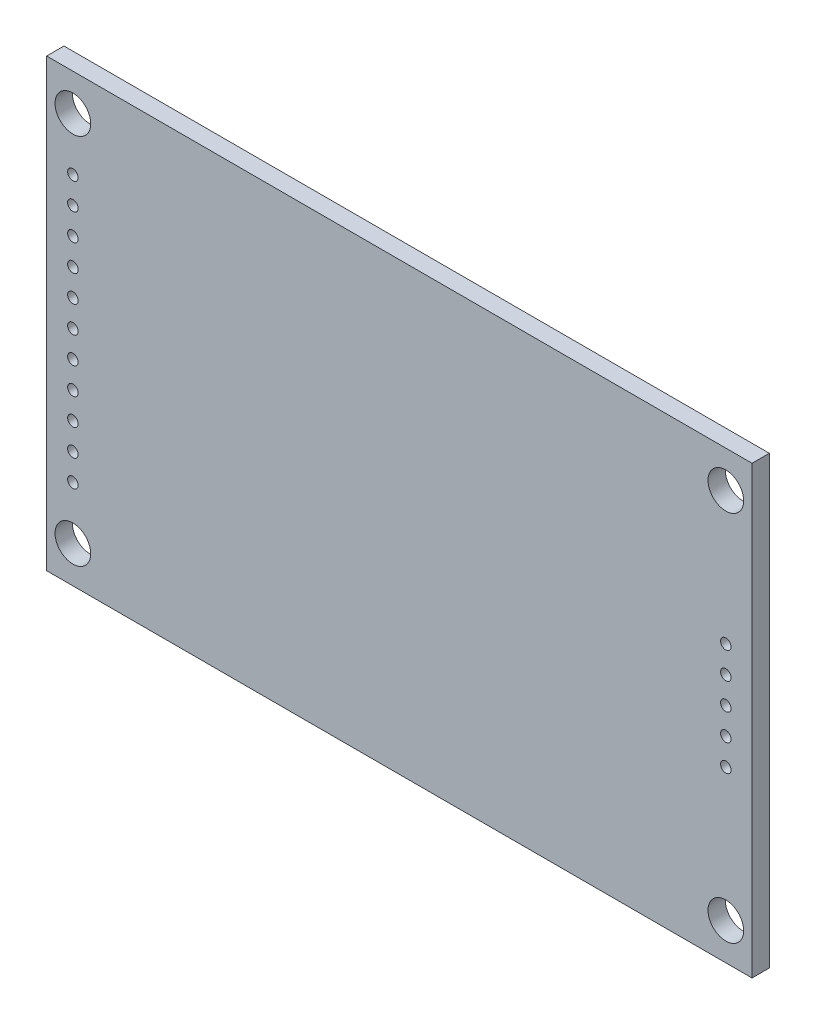
ISO-10303-21;
HEADER;
FILE_DESCRIPTION(('STEP AP214'),'2;1');
FILE_NAME('part.step','',(''),(''),'','','');
FILE_SCHEMA(('AUTOMOTIVE_DESIGN { 1 0 10303 214 1 1 1 1 }'));
ENDSEC;
DATA;
#1=APPLICATION_CONTEXT('core data for automotive mechanical design processes');
#2=APPLICATION_PROTOCOL_DEFINITION('international standard','automotive_design',2000,#1);
#3=PRODUCT_CONTEXT('',#1,'mechanical');
#4=PRODUCT('Part','Part','',(#3));
#5=PRODUCT_RELATED_PRODUCT_CATEGORY('part','',(#4));
#6=PRODUCT_DEFINITION_FORMATION('','',#4);
#7=PRODUCT_DEFINITION_CONTEXT('part definition',#1,'design');
#8=PRODUCT_DEFINITION('design','',#6,#7);
#9=PRODUCT_DEFINITION_SHAPE('','',#8);
#10=(LENGTH_UNIT() NAMED_UNIT(*) SI_UNIT(.MILLI.,.METRE.));
#11=(NAMED_UNIT(*) PLANE_ANGLE_UNIT() SI_UNIT($,.RADIAN.));
#12=(NAMED_UNIT(*) SI_UNIT($,.STERADIAN.) SOLID_ANGLE_UNIT());
#13=UNCERTAINTY_MEASURE_WITH_UNIT(LENGTH_MEASURE(1.E-05),#10,'distance_accuracy_value','');
#14=(GEOMETRIC_REPRESENTATION_CONTEXT(3) GLOBAL_UNCERTAINTY_ASSIGNED_CONTEXT((#13)) GLOBAL_UNIT_ASSIGNED_CONTEXT((#10,
#11,#12)) REPRESENTATION_CONTEXT('',''));
#15=CARTESIAN_POINT('',(0.,0.,0.));
#16=DIRECTION('',(0.,0.,1.));
#17=DIRECTION('',(1.,0.,0.));
#18=AXIS2_PLACEMENT_3D('',#15,#16,#17);
#19=CARTESIAN_POINT('',(33.625,-21.25,1.65));
#20=DIRECTION('',(-1.,0.,0.));
#21=DIRECTION('',(0.,-1.,0.));
#22=AXIS2_PLACEMENT_3D('',#19,#20,#21);
#23=PLANE('',#22);
#24=DIRECTION('',(0.,1.,0.));
#25=VECTOR('',#24,1.);
#26=CARTESIAN_POINT('',(33.625,-21.25,0.));
#27=LINE('',#26,#25);
#28=CARTESIAN_POINT('',(33.625,-21.25,0.));
#29=VERTEX_POINT('',#28);
#30=CARTESIAN_POINT('',(33.625,21.25,0.));
#31=VERTEX_POINT('',#30);
#32=EDGE_CURVE('E96',#29,#31,#27,.T.);
#33=ORIENTED_EDGE('',*,*,#32,.T.);
#34=DIRECTION('',(0.,0.,-1.));
#35=VECTOR('',#34,1.);
#36=CARTESIAN_POINT('',(33.625,21.25,1.65));
#37=LINE('',#36,#35);
#38=CARTESIAN_POINT('',(33.625,21.25,1.65));
#39=VERTEX_POINT('',#38);
#40=EDGE_CURVE('E11',#39,#31,#37,.T.);
#41=ORIENTED_EDGE('',*,*,#40,.F.);
#42=DIRECTION('',(0.,1.,0.));
#43=VECTOR('',#42,1.);
#44=CARTESIAN_POINT('',(33.625,-21.25,1.65));
#45=LINE('',#44,#43);
#46=CARTESIAN_POINT('',(33.625,-21.25,1.65));
#47=VERTEX_POINT('',#46);
#48=EDGE_CURVE('E84',#47,#39,#45,.T.);
#49=ORIENTED_EDGE('',*,*,#48,.F.);
#50=DIRECTION('',(0.,0.,-1.));
#51=VECTOR('',#50,1.);
#52=CARTESIAN_POINT('',(33.625,-21.25,1.65));
#53=LINE('',#52,#51);
#54=EDGE_CURVE('E92',#47,#29,#53,.T.);
#55=ORIENTED_EDGE('',*,*,#54,.T.);
#56=EDGE_LOOP('',(#33,#41,#49,#55));
#57=FACE_BOUND('',#56,.T.);
#58=ADVANCED_FACE('F33',(#57),#23,.F.);
#59=CARTESIAN_POINT('',(-33.625,21.25,1.65));
#60=DIRECTION('',(0.,-1.,0.));
#61=DIRECTION('',(1.,0.,0.));
#62=AXIS2_PLACEMENT_3D('',#59,#60,#61);
#63=PLANE('',#62);
#64=DIRECTION('',(-1.,0.,0.));
#65=VECTOR('',#64,1.);
#66=CARTESIAN_POINT('',(-33.625,21.25,0.));
#67=LINE('',#66,#65);
#68=CARTESIAN_POINT('',(-33.625,21.25,0.));
#69=VERTEX_POINT('',#68);
#70=EDGE_CURVE('E88',#31,#69,#67,.T.);
#71=ORIENTED_EDGE('',*,*,#70,.T.);
#72=DIRECTION('',(0.,0.,-1.));
#73=VECTOR('',#72,1.);
#74=CARTESIAN_POINT('',(-33.625,21.25,1.65));
#75=LINE('',#74,#73);
#76=CARTESIAN_POINT('',(-33.625,21.25,1.65));
#77=VERTEX_POINT('',#76);
#78=EDGE_CURVE('E41',#77,#69,#75,.T.);
#79=ORIENTED_EDGE('',*,*,#78,.F.);
#80=DIRECTION('',(-1.,0.,0.));
#81=VECTOR('',#80,1.);
#82=CARTESIAN_POINT('',(-33.625,21.25,1.65));
#83=LINE('',#82,#81);
#84=EDGE_CURVE('E79',#39,#77,#83,.T.);
#85=ORIENTED_EDGE('',*,*,#84,.F.);
#86=ORIENTED_EDGE('',*,*,#40,.T.);
#87=EDGE_LOOP('',(#71,#79,#85,#86));
#88=FACE_BOUND('',#87,.T.);
#89=ADVANCED_FACE('F87',(#88),#63,.F.);
#90=CARTESIAN_POINT('',(-33.625,-21.25,1.65));
#91=DIRECTION('',(1.,0.,0.));
#92=DIRECTION('',(0.,1.,0.));
#93=AXIS2_PLACEMENT_3D('',#90,#91,#92);
#94=PLANE('',#93);
#95=DIRECTION('',(0.,-1.,0.));
#96=VECTOR('',#95,1.);
#97=CARTESIAN_POINT('',(-33.625,-21.25,0.));
#98=LINE('',#97,#96);
#99=CARTESIAN_POINT('',(-33.625,-21.25,0.));
#100=VERTEX_POINT('',#99);
#101=EDGE_CURVE('E66',#69,#100,#98,.T.);
#102=ORIENTED_EDGE('',*,*,#101,.T.);
#103=DIRECTION('',(0.,0.,-1.));
#104=VECTOR('',#103,1.);
#105=CARTESIAN_POINT('',(-33.625,-21.25,1.65));
#106=LINE('',#105,#104);
#107=CARTESIAN_POINT('',(-33.625,-21.25,1.65));
#108=VERTEX_POINT('',#107);
#109=EDGE_CURVE('E89',#108,#100,#106,.T.);
#110=ORIENTED_EDGE('',*,*,#109,.F.);
#111=DIRECTION('',(0.,-1.,0.));
#112=VECTOR('',#111,1.);
#113=CARTESIAN_POINT('',(-33.625,-21.25,1.65));
#114=LINE('',#113,#112);
#115=EDGE_CURVE('E82',#77,#108,#114,.T.);
#116=ORIENTED_EDGE('',*,*,#115,.F.);
#117=ORIENTED_EDGE('',*,*,#78,.T.);
#118=EDGE_LOOP('',(#102,#110,#116,#117));
#119=FACE_BOUND('',#118,.T.);
#120=ADVANCED_FACE('F90',(#119),#94,.F.);
#121=CARTESIAN_POINT('',(-33.625,-21.25,1.65));
#122=DIRECTION('',(0.,1.,0.));
#123=DIRECTION('',(0.,0.,1.));
#124=AXIS2_PLACEMENT_3D('',#121,#122,#123);
#125=PLANE('',#124);
#126=DIRECTION('',(1.,0.,0.));
#127=VECTOR('',#126,1.);
#128=CARTESIAN_POINT('',(-33.625,-21.25,0.));
#129=LINE('',#128,#127);
#130=EDGE_CURVE('E72',#100,#29,#129,.T.);
#131=ORIENTED_EDGE('',*,*,#130,.T.);
#132=ORIENTED_EDGE('',*,*,#54,.F.);
#133=DIRECTION('',(1.,0.,0.));
#134=VECTOR('',#133,1.);
#135=CARTESIAN_POINT('',(-33.625,-21.25,1.65));
#136=LINE('',#135,#134);
#137=EDGE_CURVE('E49',#108,#47,#136,.T.);
#138=ORIENTED_EDGE('',*,*,#137,.F.);
#139=ORIENTED_EDGE('',*,*,#109,.T.);
#140=EDGE_LOOP('',(#131,#132,#138,#139));
#141=FACE_BOUND('',#140,.T.);
#142=ADVANCED_FACE('F104',(#141),#125,.F.);
#143=CARTESIAN_POINT('',(0.,0.,1.65));
#144=DIRECTION('',(0.,0.,-1.));
#145=DIRECTION('',(-1.,0.,0.));
#146=AXIS2_PLACEMENT_3D('',#143,#144,#145);
#147=PLANE('',#146);
#148=CARTESIAN_POINT('',(31.125,2.54000000000002,1.65));
#149=DIRECTION('',(0.,0.,1.));
#150=DIRECTION('',(1.,0.,0.));
#151=AXIS2_PLACEMENT_3D('',#148,#149,#150);
#152=CIRCLE('',#151,0.500000000000002);
#153=CARTESIAN_POINT('',(31.625,2.54000000000002,1.65));
#154=VERTEX_POINT('',#153);
#155=EDGE_CURVE('E224',#154,#154,#152,.T.);
#156=ORIENTED_EDGE('',*,*,#155,.F.);
#157=EDGE_LOOP('',(#156));
#158=FACE_BOUND('',#157,.T.);
#159=CARTESIAN_POINT('',(31.125,5.08000000000002,1.65));
#160=DIRECTION('',(0.,0.,1.));
#161=DIRECTION('',(1.,0.,0.));
#162=AXIS2_PLACEMENT_3D('',#159,#160,#161);
#163=CIRCLE('',#162,0.499999999999996);
#164=CARTESIAN_POINT('',(31.625,5.08000000000002,1.65));
#165=VERTEX_POINT('',#164);
#166=EDGE_CURVE('E218',#165,#165,#163,.T.);
#167=ORIENTED_EDGE('',*,*,#166,.F.);
#168=EDGE_LOOP('',(#167));
#169=FACE_BOUND('',#168,.T.);
#170=CARTESIAN_POINT('',(31.125,-2.53999999999998,1.65));
#171=DIRECTION('',(0.,0.,1.));
#172=DIRECTION('',(1.,0.,0.));
#173=AXIS2_PLACEMENT_3D('',#170,#171,#172);
#174=CIRCLE('',#173,0.499999999999999);
#175=CARTESIAN_POINT('',(31.625,-2.53999999999998,1.65));
#176=VERTEX_POINT('',#175);
#177=EDGE_CURVE('E212',#176,#176,#174,.T.);
#178=ORIENTED_EDGE('',*,*,#177,.F.);
#179=EDGE_LOOP('',(#178));
#180=FACE_BOUND('',#179,.T.);
#181=CARTESIAN_POINT('',(31.1250000000001,-5.07999999999998,1.65));
#182=DIRECTION('',(0.,0.,1.));
#183=DIRECTION('',(1.,0.,0.));
#184=AXIS2_PLACEMENT_3D('',#181,#182,#183);
#185=CIRCLE('',#184,0.500000000000003);
#186=CARTESIAN_POINT('',(31.6250000000001,-5.07999999999998,1.65));
#187=VERTEX_POINT('',#186);
#188=EDGE_CURVE('E206',#187,#187,#185,.T.);
#189=ORIENTED_EDGE('',*,*,#188,.F.);
#190=EDGE_LOOP('',(#189));
#191=FACE_BOUND('',#190,.T.);
#192=CARTESIAN_POINT('',(31.125,0.,1.65));
#193=DIRECTION('',(0.,0.,1.));
#194=DIRECTION('',(1.,0.,0.));
#195=AXIS2_PLACEMENT_3D('',#192,#193,#194);
#196=CIRCLE('',#195,0.499999999999999);
#197=CARTESIAN_POINT('',(31.625,0.,1.65));
#198=VERTEX_POINT('',#197);
#199=EDGE_CURVE('E200',#198,#198,#196,.T.);
#200=ORIENTED_EDGE('',*,*,#199,.F.);
#201=EDGE_LOOP('',(#200));
#202=FACE_BOUND('',#201,.T.);
#203=CARTESIAN_POINT('',(-31.125,-2.53999999999999,1.65));
#204=DIRECTION('',(0.,0.,1.));
#205=DIRECTION('',(1.,0.,0.));
#206=AXIS2_PLACEMENT_3D('',#203,#204,#205);
#207=CIRCLE('',#206,0.499999999999999);
#208=CARTESIAN_POINT('',(-30.625,-2.53999999999999,1.65));
#209=VERTEX_POINT('',#208);
#210=EDGE_CURVE('E195',#209,#209,#207,.T.);
#211=ORIENTED_EDGE('',*,*,#210,.F.);
#212=EDGE_LOOP('',(#211));
#213=FACE_BOUND('',#212,.T.);
#214=CARTESIAN_POINT('',(-31.1249999999999,-5.07999999999999,1.65));
#215=DIRECTION('',(0.,0.,1.));
#216=DIRECTION('',(1.,0.,0.));
#217=AXIS2_PLACEMENT_3D('',#214,#215,#216);
#218=CIRCLE('',#217,0.499999999999999);
#219=CARTESIAN_POINT('',(-30.6249999999999,-5.07999999999999,1.65));
#220=VERTEX_POINT('',#219);
#221=EDGE_CURVE('E189',#220,#220,#218,.T.);
#222=ORIENTED_EDGE('',*,*,#221,.F.);
#223=EDGE_LOOP('',(#222));
#224=FACE_BOUND('',#223,.T.);
#225=CARTESIAN_POINT('',(-31.1249999999999,-7.61999999999999,1.65));
#226=DIRECTION('',(0.,0.,1.));
#227=DIRECTION('',(1.,0.,0.));
#228=AXIS2_PLACEMENT_3D('',#225,#226,#227);
#229=CIRCLE('',#228,0.499999999999999);
#230=CARTESIAN_POINT('',(-30.6249999999999,-7.61999999999999,1.65));
#231=VERTEX_POINT('',#230);
#232=EDGE_CURVE('E183',#231,#231,#229,.T.);
#233=ORIENTED_EDGE('',*,*,#232,.F.);
#234=EDGE_LOOP('',(#233));
#235=FACE_BOUND('',#234,.T.);
#236=CARTESIAN_POINT('',(-31.1249999999999,-10.16,1.65));
#237=DIRECTION('',(0.,0.,1.));
#238=DIRECTION('',(1.,0.,0.));
#239=AXIS2_PLACEMENT_3D('',#236,#237,#238);
#240=CIRCLE('',#239,0.499999999999999);
#241=CARTESIAN_POINT('',(-30.6249999999999,-10.16,1.65));
#242=VERTEX_POINT('',#241);
#243=EDGE_CURVE('E177',#242,#242,#240,.T.);
#244=ORIENTED_EDGE('',*,*,#243,.F.);
#245=EDGE_LOOP('',(#244));
#246=FACE_BOUND('',#245,.T.);
#247=CARTESIAN_POINT('',(-31.1249999999999,-12.7,1.65));
#248=DIRECTION('',(0.,0.,1.));
#249=DIRECTION('',(1.,0.,0.));
#250=AXIS2_PLACEMENT_3D('',#247,#248,#249);
#251=CIRCLE('',#250,0.499999999999999);
#252=CARTESIAN_POINT('',(-30.6249999999999,-12.7,1.65));
#253=VERTEX_POINT('',#252);
#254=EDGE_CURVE('E171',#253,#253,#251,.T.);
#255=ORIENTED_EDGE('',*,*,#254,.F.);
#256=EDGE_LOOP('',(#255));
#257=FACE_BOUND('',#256,.T.);
#258=CARTESIAN_POINT('',(-31.125,2.54000000000001,1.65));
#259=DIRECTION('',(0.,0.,1.));
#260=DIRECTION('',(1.,0.,0.));
#261=AXIS2_PLACEMENT_3D('',#258,#259,#260);
#262=CIRCLE('',#261,0.499999999999999);
#263=CARTESIAN_POINT('',(-30.625,2.54000000000001,1.65));
#264=VERTEX_POINT('',#263);
#265=EDGE_CURVE('E165',#264,#264,#262,.T.);
#266=ORIENTED_EDGE('',*,*,#265,.F.);
#267=EDGE_LOOP('',(#266));
#268=FACE_BOUND('',#267,.T.);
#269=CARTESIAN_POINT('',(-31.125,5.08000000000001,1.65));
#270=DIRECTION('',(0.,0.,1.));
#271=DIRECTION('',(1.,0.,0.));
#272=AXIS2_PLACEMENT_3D('',#269,#270,#271);
#273=CIRCLE('',#272,0.499999999999999);
#274=CARTESIAN_POINT('',(-30.625,5.08000000000001,1.65));
#275=VERTEX_POINT('',#274);
#276=EDGE_CURVE('E159',#275,#275,#273,.T.);
#277=ORIENTED_EDGE('',*,*,#276,.F.);
#278=EDGE_LOOP('',(#277));
#279=FACE_BOUND('',#278,.T.);
#280=CARTESIAN_POINT('',(-31.125,7.62000000000001,1.65));
#281=DIRECTION('',(0.,0.,1.));
#282=DIRECTION('',(1.,0.,0.));
#283=AXIS2_PLACEMENT_3D('',#280,#281,#282);
#284=CIRCLE('',#283,0.499999999999999);
#285=CARTESIAN_POINT('',(-30.625,7.62000000000001,1.65));
#286=VERTEX_POINT('',#285);
#287=EDGE_CURVE('E153',#286,#286,#284,.T.);
#288=ORIENTED_EDGE('',*,*,#287,.F.);
#289=EDGE_LOOP('',(#288));
#290=FACE_BOUND('',#289,.T.);
#291=CARTESIAN_POINT('',(-31.125,10.16,1.65));
#292=DIRECTION('',(0.,0.,1.));
#293=DIRECTION('',(1.,0.,0.));
#294=AXIS2_PLACEMENT_3D('',#291,#292,#293);
#295=CIRCLE('',#294,0.499999999999999);
#296=CARTESIAN_POINT('',(-30.625,10.16,1.65));
#297=VERTEX_POINT('',#296);
#298=EDGE_CURVE('E147',#297,#297,#295,.T.);
#299=ORIENTED_EDGE('',*,*,#298,.F.);
#300=EDGE_LOOP('',(#299));
#301=FACE_BOUND('',#300,.T.);
#302=CARTESIAN_POINT('',(-31.125,12.7,1.65));
#303=DIRECTION('',(0.,0.,1.));
#304=DIRECTION('',(1.,0.,0.));
#305=AXIS2_PLACEMENT_3D('',#302,#303,#304);
#306=CIRCLE('',#305,0.499999999999999);
#307=CARTESIAN_POINT('',(-30.625,12.7,1.65));
#308=VERTEX_POINT('',#307);
#309=EDGE_CURVE('E140',#308,#308,#306,.T.);
#310=ORIENTED_EDGE('',*,*,#309,.F.);
#311=EDGE_LOOP('',(#310));
#312=FACE_BOUND('',#311,.T.);
#313=CARTESIAN_POINT('',(-31.125,0.,1.65));
#314=DIRECTION('',(0.,0.,1.));
#315=DIRECTION('',(1.,0.,0.));
#316=AXIS2_PLACEMENT_3D('',#313,#314,#315);
#317=CIRCLE('',#316,0.499999999999999);
#318=CARTESIAN_POINT('',(-30.625,0.,1.65));
#319=VERTEX_POINT('',#318);
#320=EDGE_CURVE('E134',#319,#319,#317,.T.);
#321=ORIENTED_EDGE('',*,*,#320,.F.);
#322=EDGE_LOOP('',(#321));
#323=FACE_BOUND('',#322,.T.);
#324=CARTESIAN_POINT('',(-31.125,17.75,1.65));
#325=DIRECTION('',(0.,0.,-1.));
#326=DIRECTION('',(-1.,0.,0.));
#327=AXIS2_PLACEMENT_3D('',#324,#325,#326);
#328=CIRCLE('',#327,1.7);
#329=CARTESIAN_POINT('',(-32.825,17.75,1.65));
#330=VERTEX_POINT('',#329);
#331=EDGE_CURVE('E113',#330,#330,#328,.T.);
#332=ORIENTED_EDGE('',*,*,#331,.T.);
#333=EDGE_LOOP('',(#332));
#334=FACE_BOUND('',#333,.T.);
#335=CARTESIAN_POINT('',(31.125,-17.75,1.65));
#336=DIRECTION('',(0.,0.,-1.));
#337=DIRECTION('',(-1.,0.,0.));
#338=AXIS2_PLACEMENT_3D('',#335,#336,#337);
#339=CIRCLE('',#338,1.7);
#340=CARTESIAN_POINT('',(29.425,-17.75,1.65));
#341=VERTEX_POINT('',#340);
#342=EDGE_CURVE('E126',#341,#341,#339,.T.);
#343=ORIENTED_EDGE('',*,*,#342,.T.);
#344=EDGE_LOOP('',(#343));
#345=FACE_BOUND('',#344,.T.);
#346=CARTESIAN_POINT('',(31.125,17.75,1.65));
#347=DIRECTION('',(0.,0.,-1.));
#348=DIRECTION('',(-1.,0.,0.));
#349=AXIS2_PLACEMENT_3D('',#346,#347,#348);
#350=CIRCLE('',#349,1.7);
#351=CARTESIAN_POINT('',(29.425,17.75,1.65));
#352=VERTEX_POINT('',#351);
#353=EDGE_CURVE('E119',#352,#352,#350,.T.);
#354=ORIENTED_EDGE('',*,*,#353,.T.);
#355=EDGE_LOOP('',(#354));
#356=FACE_BOUND('',#355,.T.);
#357=CARTESIAN_POINT('',(-31.125,-17.75,1.65));
#358=DIRECTION('',(0.,0.,-1.));
#359=DIRECTION('',(-1.,0.,0.));
#360=AXIS2_PLACEMENT_3D('',#357,#358,#359);
#361=CIRCLE('',#360,1.7);
#362=CARTESIAN_POINT('',(-32.825,-17.75,1.65));
#363=VERTEX_POINT('',#362);
#364=EDGE_CURVE('E99',#363,#363,#361,.T.);
#365=ORIENTED_EDGE('',*,*,#364,.T.);
#366=EDGE_LOOP('',(#365));
#367=FACE_BOUND('',#366,.T.);
#368=ORIENTED_EDGE('',*,*,#48,.T.);
#369=ORIENTED_EDGE('',*,*,#84,.T.);
#370=ORIENTED_EDGE('',*,*,#115,.T.);
#371=ORIENTED_EDGE('',*,*,#137,.T.);
#372=EDGE_LOOP('',(#368,#369,#370,#371));
#373=FACE_BOUND('',#372,.T.);
#374=ADVANCED_FACE('F80',(#158,#169,#180,#191,#202,#213,#224,#235,#246,#257,#268,#279,#290,#301,
#312,#323,#334,#345,#356,#367,#373),#147,.F.);
#375=CARTESIAN_POINT('',(0.,0.,0.));
#376=DIRECTION('',(0.,0.,-1.));
#377=DIRECTION('',(-1.,0.,0.));
#378=AXIS2_PLACEMENT_3D('',#375,#376,#377);
#379=PLANE('',#378);
#380=CARTESIAN_POINT('',(31.125,2.54000000000002,0.));
#381=DIRECTION('',(0.,0.,1.));
#382=DIRECTION('',(1.,0.,0.));
#383=AXIS2_PLACEMENT_3D('',#380,#381,#382);
#384=CIRCLE('',#383,0.500000000000002);
#385=CARTESIAN_POINT('',(31.625,2.54000000000002,0.));
#386=VERTEX_POINT('',#385);
#387=EDGE_CURVE('E203',#386,#386,#384,.T.);
#388=ORIENTED_EDGE('',*,*,#387,.T.);
#389=EDGE_LOOP('',(#388));
#390=FACE_BOUND('',#389,.T.);
#391=CARTESIAN_POINT('',(31.125,5.08000000000002,0.));
#392=DIRECTION('',(0.,0.,1.));
#393=DIRECTION('',(1.,0.,0.));
#394=AXIS2_PLACEMENT_3D('',#391,#392,#393);
#395=CIRCLE('',#394,0.499999999999996);
#396=CARTESIAN_POINT('',(31.625,5.08000000000002,0.));
#397=VERTEX_POINT('',#396);
#398=EDGE_CURVE('E221',#397,#397,#395,.T.);
#399=ORIENTED_EDGE('',*,*,#398,.T.);
#400=EDGE_LOOP('',(#399));
#401=FACE_BOUND('',#400,.T.);
#402=CARTESIAN_POINT('',(31.125,-2.53999999999998,0.));
#403=DIRECTION('',(0.,0.,1.));
#404=DIRECTION('',(1.,0.,0.));
#405=AXIS2_PLACEMENT_3D('',#402,#403,#404);
#406=CIRCLE('',#405,0.499999999999999);
#407=CARTESIAN_POINT('',(31.625,-2.53999999999998,0.));
#408=VERTEX_POINT('',#407);
#409=EDGE_CURVE('E215',#408,#408,#406,.T.);
#410=ORIENTED_EDGE('',*,*,#409,.T.);
#411=EDGE_LOOP('',(#410));
#412=FACE_BOUND('',#411,.T.);
#413=CARTESIAN_POINT('',(31.1250000000001,-5.07999999999998,0.));
#414=DIRECTION('',(0.,0.,1.));
#415=DIRECTION('',(1.,0.,0.));
#416=AXIS2_PLACEMENT_3D('',#413,#414,#415);
#417=CIRCLE('',#416,0.500000000000003);
#418=CARTESIAN_POINT('',(31.6250000000001,-5.07999999999998,0.));
#419=VERTEX_POINT('',#418);
#420=EDGE_CURVE('E209',#419,#419,#417,.T.);
#421=ORIENTED_EDGE('',*,*,#420,.T.);
#422=EDGE_LOOP('',(#421));
#423=FACE_BOUND('',#422,.T.);
#424=CARTESIAN_POINT('',(31.125,0.,0.));
#425=DIRECTION('',(0.,0.,1.));
#426=DIRECTION('',(1.,0.,0.));
#427=AXIS2_PLACEMENT_3D('',#424,#425,#426);
#428=CIRCLE('',#427,0.499999999999999);
#429=CARTESIAN_POINT('',(31.625,0.,0.));
#430=VERTEX_POINT('',#429);
#431=EDGE_CURVE('E144',#430,#430,#428,.T.);
#432=ORIENTED_EDGE('',*,*,#431,.T.);
#433=EDGE_LOOP('',(#432));
#434=FACE_BOUND('',#433,.T.);
#435=CARTESIAN_POINT('',(-31.125,-2.53999999999999,0.));
#436=DIRECTION('',(0.,0.,1.));
#437=DIRECTION('',(1.,0.,0.));
#438=AXIS2_PLACEMENT_3D('',#435,#436,#437);
#439=CIRCLE('',#438,0.499999999999999);
#440=CARTESIAN_POINT('',(-30.625,-2.53999999999999,0.));
#441=VERTEX_POINT('',#440);
#442=EDGE_CURVE('E137',#441,#441,#439,.T.);
#443=ORIENTED_EDGE('',*,*,#442,.T.);
#444=EDGE_LOOP('',(#443));
#445=FACE_BOUND('',#444,.T.);
#446=CARTESIAN_POINT('',(-31.1249999999999,-5.07999999999999,0.));
#447=DIRECTION('',(0.,0.,1.));
#448=DIRECTION('',(1.,0.,0.));
#449=AXIS2_PLACEMENT_3D('',#446,#447,#448);
#450=CIRCLE('',#449,0.499999999999999);
#451=CARTESIAN_POINT('',(-30.6249999999999,-5.07999999999999,0.));
#452=VERTEX_POINT('',#451);
#453=EDGE_CURVE('E192',#452,#452,#450,.T.);
#454=ORIENTED_EDGE('',*,*,#453,.T.);
#455=EDGE_LOOP('',(#454));
#456=FACE_BOUND('',#455,.T.);
#457=CARTESIAN_POINT('',(-31.1249999999999,-7.61999999999999,0.));
#458=DIRECTION('',(0.,0.,1.));
#459=DIRECTION('',(1.,0.,0.));
#460=AXIS2_PLACEMENT_3D('',#457,#458,#459);
#461=CIRCLE('',#460,0.499999999999999);
#462=CARTESIAN_POINT('',(-30.6249999999999,-7.61999999999999,0.));
#463=VERTEX_POINT('',#462);
#464=EDGE_CURVE('E186',#463,#463,#461,.T.);
#465=ORIENTED_EDGE('',*,*,#464,.T.);
#466=EDGE_LOOP('',(#465));
#467=FACE_BOUND('',#466,.T.);
#468=CARTESIAN_POINT('',(-31.1249999999999,-10.16,0.));
#469=DIRECTION('',(0.,0.,1.));
#470=DIRECTION('',(1.,0.,0.));
#471=AXIS2_PLACEMENT_3D('',#468,#469,#470);
#472=CIRCLE('',#471,0.499999999999999);
#473=CARTESIAN_POINT('',(-30.6249999999999,-10.16,0.));
#474=VERTEX_POINT('',#473);
#475=EDGE_CURVE('E180',#474,#474,#472,.T.);
#476=ORIENTED_EDGE('',*,*,#475,.T.);
#477=EDGE_LOOP('',(#476));
#478=FACE_BOUND('',#477,.T.);
#479=CARTESIAN_POINT('',(-31.1249999999999,-12.7,0.));
#480=DIRECTION('',(0.,0.,1.));
#481=DIRECTION('',(1.,0.,0.));
#482=AXIS2_PLACEMENT_3D('',#479,#480,#481);
#483=CIRCLE('',#482,0.499999999999999);
#484=CARTESIAN_POINT('',(-30.6249999999999,-12.7,0.));
#485=VERTEX_POINT('',#484);
#486=EDGE_CURVE('E174',#485,#485,#483,.T.);
#487=ORIENTED_EDGE('',*,*,#486,.T.);
#488=EDGE_LOOP('',(#487));
#489=FACE_BOUND('',#488,.T.);
#490=CARTESIAN_POINT('',(-31.125,2.54000000000001,0.));
#491=DIRECTION('',(0.,0.,1.));
#492=DIRECTION('',(1.,0.,0.));
#493=AXIS2_PLACEMENT_3D('',#490,#491,#492);
#494=CIRCLE('',#493,0.499999999999999);
#495=CARTESIAN_POINT('',(-30.625,2.54000000000001,0.));
#496=VERTEX_POINT('',#495);
#497=EDGE_CURVE('E168',#496,#496,#494,.T.);
#498=ORIENTED_EDGE('',*,*,#497,.T.);
#499=EDGE_LOOP('',(#498));
#500=FACE_BOUND('',#499,.T.);
#501=CARTESIAN_POINT('',(-31.125,5.08000000000001,0.));
#502=DIRECTION('',(0.,0.,1.));
#503=DIRECTION('',(1.,0.,0.));
#504=AXIS2_PLACEMENT_3D('',#501,#502,#503);
#505=CIRCLE('',#504,0.499999999999999);
#506=CARTESIAN_POINT('',(-30.625,5.08000000000001,0.));
#507=VERTEX_POINT('',#506);
#508=EDGE_CURVE('E162',#507,#507,#505,.T.);
#509=ORIENTED_EDGE('',*,*,#508,.T.);
#510=EDGE_LOOP('',(#509));
#511=FACE_BOUND('',#510,.T.);
#512=CARTESIAN_POINT('',(-31.125,7.62000000000001,0.));
#513=DIRECTION('',(0.,0.,1.));
#514=DIRECTION('',(1.,0.,0.));
#515=AXIS2_PLACEMENT_3D('',#512,#513,#514);
#516=CIRCLE('',#515,0.499999999999999);
#517=CARTESIAN_POINT('',(-30.625,7.62000000000001,0.));
#518=VERTEX_POINT('',#517);
#519=EDGE_CURVE('E156',#518,#518,#516,.T.);
#520=ORIENTED_EDGE('',*,*,#519,.T.);
#521=EDGE_LOOP('',(#520));
#522=FACE_BOUND('',#521,.T.);
#523=CARTESIAN_POINT('',(-31.125,10.16,0.));
#524=DIRECTION('',(0.,0.,1.));
#525=DIRECTION('',(1.,0.,0.));
#526=AXIS2_PLACEMENT_3D('',#523,#524,#525);
#527=CIRCLE('',#526,0.499999999999999);
#528=CARTESIAN_POINT('',(-30.625,10.16,0.));
#529=VERTEX_POINT('',#528);
#530=EDGE_CURVE('E150',#529,#529,#527,.T.);
#531=ORIENTED_EDGE('',*,*,#530,.T.);
#532=EDGE_LOOP('',(#531));
#533=FACE_BOUND('',#532,.T.);
#534=CARTESIAN_POINT('',(-31.125,12.7,0.));
#535=DIRECTION('',(0.,0.,1.));
#536=DIRECTION('',(1.,0.,0.));
#537=AXIS2_PLACEMENT_3D('',#534,#535,#536);
#538=CIRCLE('',#537,0.499999999999999);
#539=CARTESIAN_POINT('',(-30.625,12.7,0.));
#540=VERTEX_POINT('',#539);
#541=EDGE_CURVE('E143',#540,#540,#538,.T.);
#542=ORIENTED_EDGE('',*,*,#541,.T.);
#543=EDGE_LOOP('',(#542));
#544=FACE_BOUND('',#543,.T.);
#545=CARTESIAN_POINT('',(-31.125,0.,0.));
#546=DIRECTION('',(0.,0.,1.));
#547=DIRECTION('',(1.,0.,0.));
#548=AXIS2_PLACEMENT_3D('',#545,#546,#547);
#549=CIRCLE('',#548,0.499999999999999);
#550=CARTESIAN_POINT('',(-30.625,0.,0.));
#551=VERTEX_POINT('',#550);
#552=EDGE_CURVE('E120',#551,#551,#549,.T.);
#553=ORIENTED_EDGE('',*,*,#552,.T.);
#554=EDGE_LOOP('',(#553));
#555=FACE_BOUND('',#554,.T.);
#556=CARTESIAN_POINT('',(-31.125,17.75,0.));
#557=DIRECTION('',(0.,0.,-1.));
#558=DIRECTION('',(-1.,0.,0.));
#559=AXIS2_PLACEMENT_3D('',#556,#557,#558);
#560=CIRCLE('',#559,1.7);
#561=CARTESIAN_POINT('',(-32.825,17.75,0.));
#562=VERTEX_POINT('',#561);
#563=EDGE_CURVE('E129',#562,#562,#560,.T.);
#564=ORIENTED_EDGE('',*,*,#563,.F.);
#565=EDGE_LOOP('',(#564));
#566=FACE_BOUND('',#565,.T.);
#567=CARTESIAN_POINT('',(31.125,-17.75,0.));
#568=DIRECTION('',(0.,0.,-1.));
#569=DIRECTION('',(-1.,0.,0.));
#570=AXIS2_PLACEMENT_3D('',#567,#568,#569);
#571=CIRCLE('',#570,1.7);
#572=CARTESIAN_POINT('',(29.425,-17.75,0.));
#573=VERTEX_POINT('',#572);
#574=EDGE_CURVE('E123',#573,#573,#571,.T.);
#575=ORIENTED_EDGE('',*,*,#574,.F.);
#576=EDGE_LOOP('',(#575));
#577=FACE_BOUND('',#576,.T.);
#578=CARTESIAN_POINT('',(31.125,17.75,0.));
#579=DIRECTION('',(0.,0.,-1.));
#580=DIRECTION('',(-1.,0.,0.));
#581=AXIS2_PLACEMENT_3D('',#578,#579,#580);
#582=CIRCLE('',#581,1.7);
#583=CARTESIAN_POINT('',(29.425,17.75,0.));
#584=VERTEX_POINT('',#583);
#585=EDGE_CURVE('E116',#584,#584,#582,.T.);
#586=ORIENTED_EDGE('',*,*,#585,.F.);
#587=EDGE_LOOP('',(#586));
#588=FACE_BOUND('',#587,.T.);
#589=CARTESIAN_POINT('',(-31.125,-17.75,0.));
#590=DIRECTION('',(0.,0.,-1.));
#591=DIRECTION('',(-1.,0.,0.));
#592=AXIS2_PLACEMENT_3D('',#589,#590,#591);
#593=CIRCLE('',#592,1.7);
#594=CARTESIAN_POINT('',(-32.825,-17.75,0.));
#595=VERTEX_POINT('',#594);
#596=EDGE_CURVE('E110',#595,#595,#593,.T.);
#597=ORIENTED_EDGE('',*,*,#596,.F.);
#598=EDGE_LOOP('',(#597));
#599=FACE_BOUND('',#598,.T.);
#600=ORIENTED_EDGE('',*,*,#32,.F.);
#601=ORIENTED_EDGE('',*,*,#130,.F.);
#602=ORIENTED_EDGE('',*,*,#101,.F.);
#603=ORIENTED_EDGE('',*,*,#70,.F.);
#604=EDGE_LOOP('',(#600,#601,#602,#603));
#605=FACE_BOUND('',#604,.T.);
#606=ADVANCED_FACE('F107',(#390,#401,#412,#423,#434,#445,#456,#467,#478,#489,#500,#511,#522,
#533,#544,#555,#566,#577,#588,#599,#605),#379,.T.);
#607=CARTESIAN_POINT('',(-31.125,-17.75,1.65));
#608=DIRECTION('',(0.,0.,-1.));
#609=DIRECTION('',(-1.,0.,0.));
#610=AXIS2_PLACEMENT_3D('',#607,#608,#609);
#611=CYLINDRICAL_SURFACE('',#610,1.7);
#612=ORIENTED_EDGE('',*,*,#364,.F.);
#613=EDGE_LOOP('',(#612));
#614=FACE_BOUND('',#613,.T.);
#615=ORIENTED_EDGE('',*,*,#596,.T.);
#616=EDGE_LOOP('',(#615));
#617=FACE_BOUND('',#616,.T.);
#618=ADVANCED_FACE('F280',(#614,#617),#611,.F.);
#619=CARTESIAN_POINT('',(31.125,17.75,1.65));
#620=DIRECTION('',(0.,0.,-1.));
#621=DIRECTION('',(-1.,0.,0.));
#622=AXIS2_PLACEMENT_3D('',#619,#620,#621);
#623=CYLINDRICAL_SURFACE('',#622,1.7);
#624=ORIENTED_EDGE('',*,*,#353,.F.);
#625=EDGE_LOOP('',(#624));
#626=FACE_BOUND('',#625,.T.);
#627=ORIENTED_EDGE('',*,*,#585,.T.);
#628=EDGE_LOOP('',(#627));
#629=FACE_BOUND('',#628,.T.);
#630=ADVANCED_FACE('F283',(#626,#629),#623,.F.);
#631=CARTESIAN_POINT('',(31.125,-17.75,1.65));
#632=DIRECTION('',(0.,0.,-1.));
#633=DIRECTION('',(-1.,0.,0.));
#634=AXIS2_PLACEMENT_3D('',#631,#632,#633);
#635=CYLINDRICAL_SURFACE('',#634,1.7);
#636=ORIENTED_EDGE('',*,*,#342,.F.);
#637=EDGE_LOOP('',(#636));
#638=FACE_BOUND('',#637,.T.);
#639=ORIENTED_EDGE('',*,*,#574,.T.);
#640=EDGE_LOOP('',(#639));
#641=FACE_BOUND('',#640,.T.);
#642=ADVANCED_FACE('F418',(#638,#641),#635,.F.);
#643=CARTESIAN_POINT('',(-31.125,17.75,1.65));
#644=DIRECTION('',(0.,0.,-1.));
#645=DIRECTION('',(-1.,0.,0.));
#646=AXIS2_PLACEMENT_3D('',#643,#644,#645);
#647=CYLINDRICAL_SURFACE('',#646,1.7);
#648=ORIENTED_EDGE('',*,*,#331,.F.);
#649=EDGE_LOOP('',(#648));
#650=FACE_BOUND('',#649,.T.);
#651=ORIENTED_EDGE('',*,*,#563,.T.);
#652=EDGE_LOOP('',(#651));
#653=FACE_BOUND('',#652,.T.);
#654=ADVANCED_FACE('F414',(#650,#653),#647,.F.);
#655=CARTESIAN_POINT('',(-31.125,0.,0.));
#656=DIRECTION('',(0.,0.,1.));
#657=DIRECTION('',(1.,0.,0.));
#658=AXIS2_PLACEMENT_3D('',#655,#656,#657);
#659=CYLINDRICAL_SURFACE('',#658,0.499999999999999);
#660=ORIENTED_EDGE('',*,*,#552,.F.);
#661=EDGE_LOOP('',(#660));
#662=FACE_BOUND('',#661,.T.);
#663=ORIENTED_EDGE('',*,*,#320,.T.);
#664=EDGE_LOOP('',(#663));
#665=FACE_BOUND('',#664,.T.);
#666=ADVANCED_FACE('F410',(#662,#665),#659,.F.);
#667=CARTESIAN_POINT('',(-31.125,12.7,0.));
#668=DIRECTION('',(0.,0.,1.));
#669=DIRECTION('',(1.,0.,0.));
#670=AXIS2_PLACEMENT_3D('',#667,#668,#669);
#671=CYLINDRICAL_SURFACE('',#670,0.499999999999999);
#672=ORIENTED_EDGE('',*,*,#541,.F.);
#673=EDGE_LOOP('',(#672));
#674=FACE_BOUND('',#673,.T.);
#675=ORIENTED_EDGE('',*,*,#309,.T.);
#676=EDGE_LOOP('',(#675));
#677=FACE_BOUND('',#676,.T.);
#678=ADVANCED_FACE('F406',(#674,#677),#671,.F.);
#679=CARTESIAN_POINT('',(-31.125,10.16,0.));
#680=DIRECTION('',(0.,0.,1.));
#681=DIRECTION('',(1.,0.,0.));
#682=AXIS2_PLACEMENT_3D('',#679,#680,#681);
#683=CYLINDRICAL_SURFACE('',#682,0.499999999999999);
#684=ORIENTED_EDGE('',*,*,#530,.F.);
#685=EDGE_LOOP('',(#684));
#686=FACE_BOUND('',#685,.T.);
#687=ORIENTED_EDGE('',*,*,#298,.T.);
#688=EDGE_LOOP('',(#687));
#689=FACE_BOUND('',#688,.T.);
#690=ADVANCED_FACE('F402',(#686,#689),#683,.F.);
#691=CARTESIAN_POINT('',(-31.125,7.62000000000001,0.));
#692=DIRECTION('',(0.,0.,1.));
#693=DIRECTION('',(1.,0.,0.));
#694=AXIS2_PLACEMENT_3D('',#691,#692,#693);
#695=CYLINDRICAL_SURFACE('',#694,0.499999999999999);
#696=ORIENTED_EDGE('',*,*,#519,.F.);
#697=EDGE_LOOP('',(#696));
#698=FACE_BOUND('',#697,.T.);
#699=ORIENTED_EDGE('',*,*,#287,.T.);
#700=EDGE_LOOP('',(#699));
#701=FACE_BOUND('',#700,.T.);
#702=ADVANCED_FACE('F398',(#698,#701),#695,.F.);
#703=CARTESIAN_POINT('',(-31.125,5.08000000000001,0.));
#704=DIRECTION('',(0.,0.,1.));
#705=DIRECTION('',(1.,0.,0.));
#706=AXIS2_PLACEMENT_3D('',#703,#704,#705);
#707=CYLINDRICAL_SURFACE('',#706,0.499999999999999);
#708=ORIENTED_EDGE('',*,*,#508,.F.);
#709=EDGE_LOOP('',(#708));
#710=FACE_BOUND('',#709,.T.);
#711=ORIENTED_EDGE('',*,*,#276,.T.);
#712=EDGE_LOOP('',(#711));
#713=FACE_BOUND('',#712,.T.);
#714=ADVANCED_FACE('F394',(#710,#713),#707,.F.);
#715=CARTESIAN_POINT('',(-31.125,2.54000000000001,0.));
#716=DIRECTION('',(0.,0.,1.));
#717=DIRECTION('',(1.,0.,0.));
#718=AXIS2_PLACEMENT_3D('',#715,#716,#717);
#719=CYLINDRICAL_SURFACE('',#718,0.499999999999999);
#720=ORIENTED_EDGE('',*,*,#497,.F.);
#721=EDGE_LOOP('',(#720));
#722=FACE_BOUND('',#721,.T.);
#723=ORIENTED_EDGE('',*,*,#265,.T.);
#724=EDGE_LOOP('',(#723));
#725=FACE_BOUND('',#724,.T.);
#726=ADVANCED_FACE('F390',(#722,#725),#719,.F.);
#727=CARTESIAN_POINT('',(-31.1249999999999,-12.7,0.));
#728=DIRECTION('',(0.,0.,1.));
#729=DIRECTION('',(1.,0.,0.));
#730=AXIS2_PLACEMENT_3D('',#727,#728,#729);
#731=CYLINDRICAL_SURFACE('',#730,0.499999999999999);
#732=ORIENTED_EDGE('',*,*,#486,.F.);
#733=EDGE_LOOP('',(#732));
#734=FACE_BOUND('',#733,.T.);
#735=ORIENTED_EDGE('',*,*,#254,.T.);
#736=EDGE_LOOP('',(#735));
#737=FACE_BOUND('',#736,.T.);
#738=ADVANCED_FACE('F386',(#734,#737),#731,.F.);
#739=CARTESIAN_POINT('',(-31.1249999999999,-10.16,0.));
#740=DIRECTION('',(0.,0.,1.));
#741=DIRECTION('',(1.,0.,0.));
#742=AXIS2_PLACEMENT_3D('',#739,#740,#741);
#743=CYLINDRICAL_SURFACE('',#742,0.499999999999999);
#744=ORIENTED_EDGE('',*,*,#475,.F.);
#745=EDGE_LOOP('',(#744));
#746=FACE_BOUND('',#745,.T.);
#747=ORIENTED_EDGE('',*,*,#243,.T.);
#748=EDGE_LOOP('',(#747));
#749=FACE_BOUND('',#748,.T.);
#750=ADVANCED_FACE('F382',(#746,#749),#743,.F.);
#751=CARTESIAN_POINT('',(-31.1249999999999,-7.61999999999999,0.));
#752=DIRECTION('',(0.,0.,1.));
#753=DIRECTION('',(1.,0.,0.));
#754=AXIS2_PLACEMENT_3D('',#751,#752,#753);
#755=CYLINDRICAL_SURFACE('',#754,0.499999999999999);
#756=ORIENTED_EDGE('',*,*,#464,.F.);
#757=EDGE_LOOP('',(#756));
#758=FACE_BOUND('',#757,.T.);
#759=ORIENTED_EDGE('',*,*,#232,.T.);
#760=EDGE_LOOP('',(#759));
#761=FACE_BOUND('',#760,.T.);
#762=ADVANCED_FACE('F378',(#758,#761),#755,.F.);
#763=CARTESIAN_POINT('',(-31.1249999999999,-5.07999999999999,0.));
#764=DIRECTION('',(0.,0.,1.));
#765=DIRECTION('',(1.,0.,0.));
#766=AXIS2_PLACEMENT_3D('',#763,#764,#765);
#767=CYLINDRICAL_SURFACE('',#766,0.499999999999999);
#768=ORIENTED_EDGE('',*,*,#453,.F.);
#769=EDGE_LOOP('',(#768));
#770=FACE_BOUND('',#769,.T.);
#771=ORIENTED_EDGE('',*,*,#221,.T.);
#772=EDGE_LOOP('',(#771));
#773=FACE_BOUND('',#772,.T.);
#774=ADVANCED_FACE('F374',(#770,#773),#767,.F.);
#775=CARTESIAN_POINT('',(-31.125,-2.53999999999999,0.));
#776=DIRECTION('',(0.,0.,1.));
#777=DIRECTION('',(1.,0.,0.));
#778=AXIS2_PLACEMENT_3D('',#775,#776,#777);
#779=CYLINDRICAL_SURFACE('',#778,0.499999999999999);
#780=ORIENTED_EDGE('',*,*,#442,.F.);
#781=EDGE_LOOP('',(#780));
#782=FACE_BOUND('',#781,.T.);
#783=ORIENTED_EDGE('',*,*,#210,.T.);
#784=EDGE_LOOP('',(#783));
#785=FACE_BOUND('',#784,.T.);
#786=ADVANCED_FACE('F316',(#782,#785),#779,.F.);
#787=CARTESIAN_POINT('',(31.125,0.,0.));
#788=DIRECTION('',(0.,0.,1.));
#789=DIRECTION('',(1.,0.,0.));
#790=AXIS2_PLACEMENT_3D('',#787,#788,#789);
#791=CYLINDRICAL_SURFACE('',#790,0.499999999999999);
#792=ORIENTED_EDGE('',*,*,#431,.F.);
#793=EDGE_LOOP('',(#792));
#794=FACE_BOUND('',#793,.T.);
#795=ORIENTED_EDGE('',*,*,#199,.T.);
#796=EDGE_LOOP('',(#795));
#797=FACE_BOUND('',#796,.T.);
#798=ADVANCED_FACE('F326',(#794,#797),#791,.F.);
#799=CARTESIAN_POINT('',(31.1250000000001,-5.07999999999998,0.));
#800=DIRECTION('',(0.,0.,1.));
#801=DIRECTION('',(1.,0.,0.));
#802=AXIS2_PLACEMENT_3D('',#799,#800,#801);
#803=CYLINDRICAL_SURFACE('',#802,0.500000000000003);
#804=ORIENTED_EDGE('',*,*,#420,.F.);
#805=EDGE_LOOP('',(#804));
#806=FACE_BOUND('',#805,.T.);
#807=ORIENTED_EDGE('',*,*,#188,.T.);
#808=EDGE_LOOP('',(#807));
#809=FACE_BOUND('',#808,.T.);
#810=ADVANCED_FACE('F331',(#806,#809),#803,.F.);
#811=CARTESIAN_POINT('',(31.125,-2.53999999999998,0.));
#812=DIRECTION('',(0.,0.,1.));
#813=DIRECTION('',(1.,0.,0.));
#814=AXIS2_PLACEMENT_3D('',#811,#812,#813);
#815=CYLINDRICAL_SURFACE('',#814,0.499999999999999);
#816=ORIENTED_EDGE('',*,*,#409,.F.);
#817=EDGE_LOOP('',(#816));
#818=FACE_BOUND('',#817,.T.);
#819=ORIENTED_EDGE('',*,*,#177,.T.);
#820=EDGE_LOOP('',(#819));
#821=FACE_BOUND('',#820,.T.);
#822=ADVANCED_FACE('F341',(#818,#821),#815,.F.);
#823=CARTESIAN_POINT('',(31.125,5.08000000000002,0.));
#824=DIRECTION('',(0.,0.,1.));
#825=DIRECTION('',(1.,0.,0.));
#826=AXIS2_PLACEMENT_3D('',#823,#824,#825);
#827=CYLINDRICAL_SURFACE('',#826,0.499999999999996);
#828=ORIENTED_EDGE('',*,*,#398,.F.);
#829=EDGE_LOOP('',(#828));
#830=FACE_BOUND('',#829,.T.);
#831=ORIENTED_EDGE('',*,*,#166,.T.);
#832=EDGE_LOOP('',(#831));
#833=FACE_BOUND('',#832,.T.);
#834=ADVANCED_FACE('F235',(#830,#833),#827,.F.);
#835=CARTESIAN_POINT('',(31.125,2.54000000000002,0.));
#836=DIRECTION('',(0.,0.,1.));
#837=DIRECTION('',(1.,0.,0.));
#838=AXIS2_PLACEMENT_3D('',#835,#836,#837);
#839=CYLINDRICAL_SURFACE('',#838,0.500000000000002);
#840=ORIENTED_EDGE('',*,*,#387,.F.);
#841=EDGE_LOOP('',(#840));
#842=FACE_BOUND('',#841,.T.);
#843=ORIENTED_EDGE('',*,*,#155,.T.);
#844=EDGE_LOOP('',(#843));
#845=FACE_BOUND('',#844,.T.);
#846=ADVANCED_FACE('F232',(#842,#845),#839,.F.);
#847=CLOSED_SHELL('',(#58,#89,#120,#142,#374,#606,#618,#630,#642,#654,#666,#678,#690,#702,#714,
#726,#738,#750,#762,#774,#786,#798,#810,#822,#834,#846));
#848=MANIFOLD_SOLID_BREP('B2',#847);
#849=ADVANCED_BREP_SHAPE_REPRESENTATION('',(#18,#848),#14);
#850=SHAPE_DEFINITION_REPRESENTATION(#9,#849);
ENDSEC;
END-ISO-10303-21;
